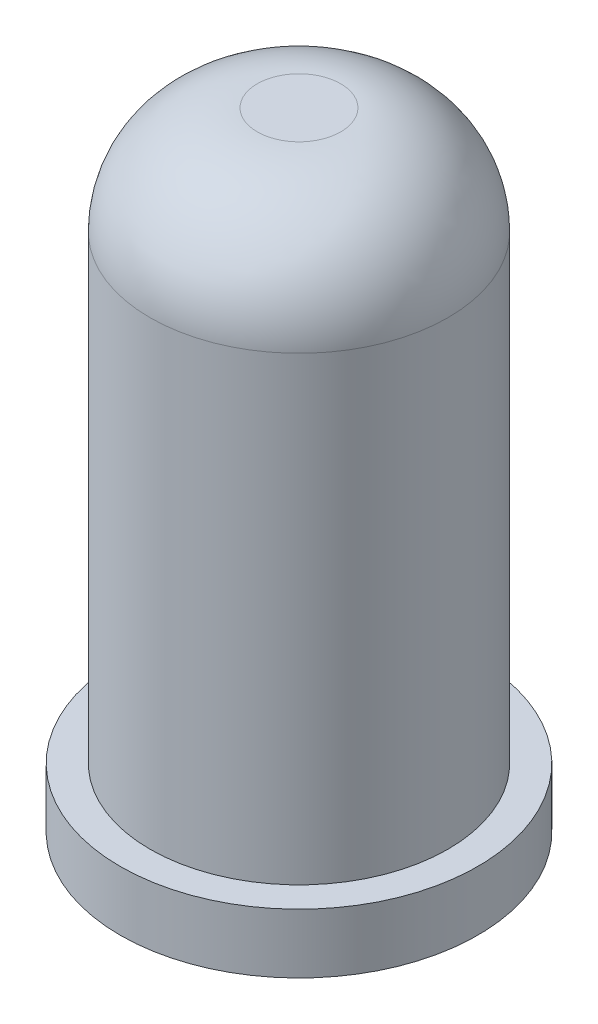
ISO-10303-21;
HEADER;
FILE_DESCRIPTION(('STEP AP214'),'2;1');
FILE_NAME('part.step','',(''),(''),'','','');
FILE_SCHEMA(('AUTOMOTIVE_DESIGN { 1 0 10303 214 1 1 1 1 }'));
ENDSEC;
DATA;
#1=APPLICATION_CONTEXT('core data for automotive mechanical design processes');
#2=APPLICATION_PROTOCOL_DEFINITION('international standard','automotive_design',2000,#1);
#3=PRODUCT_CONTEXT('',#1,'mechanical');
#4=PRODUCT('Part','Part','',(#3));
#5=PRODUCT_RELATED_PRODUCT_CATEGORY('part','',(#4));
#6=PRODUCT_DEFINITION_FORMATION('','',#4);
#7=PRODUCT_DEFINITION_CONTEXT('part definition',#1,'design');
#8=PRODUCT_DEFINITION('design','',#6,#7);
#9=PRODUCT_DEFINITION_SHAPE('','',#8);
#10=(LENGTH_UNIT() NAMED_UNIT(*) SI_UNIT(.MILLI.,.METRE.));
#11=(NAMED_UNIT(*) PLANE_ANGLE_UNIT() SI_UNIT($,.RADIAN.));
#12=(NAMED_UNIT(*) SI_UNIT($,.STERADIAN.) SOLID_ANGLE_UNIT());
#13=UNCERTAINTY_MEASURE_WITH_UNIT(LENGTH_MEASURE(1.E-05),#10,'distance_accuracy_value','');
#14=(GEOMETRIC_REPRESENTATION_CONTEXT(3) GLOBAL_UNCERTAINTY_ASSIGNED_CONTEXT((#13)) GLOBAL_UNIT_ASSIGNED_CONTEXT((#10,
#11,#12)) REPRESENTATION_CONTEXT('',''));
#15=CARTESIAN_POINT('',(0.,0.,0.));
#16=DIRECTION('',(0.,0.,1.));
#17=DIRECTION('',(1.,0.,0.));
#18=AXIS2_PLACEMENT_3D('',#15,#16,#17);
#19=CARTESIAN_POINT('',(0.,9.525,0.));
#20=DIRECTION('',(0.,-1.,0.));
#21=DIRECTION('',(0.,0.,-1.));
#22=AXIS2_PLACEMENT_3D('',#19,#20,#21);
#23=CYLINDRICAL_SURFACE('',#22,2.5);
#24=CARTESIAN_POINT('',(0.,7.725,0.));
#25=DIRECTION('',(0.,1.,0.));
#26=DIRECTION('',(0.,0.,1.));
#27=AXIS2_PLACEMENT_3D('',#24,#25,#26);
#28=CIRCLE('',#27,2.5);
#29=CARTESIAN_POINT('',(0.,7.725,2.5));
#30=VERTEX_POINT('',#29);
#31=EDGE_CURVE('E10',#30,#30,#28,.F.);
#32=ORIENTED_EDGE('',*,*,#31,.T.);
#33=EDGE_LOOP('',(#32));
#34=FACE_BOUND('',#33,.T.);
#35=CARTESIAN_POINT('',(0.,0.,0.));
#36=DIRECTION('',(0.,-1.,0.));
#37=DIRECTION('',(0.,0.,-1.));
#38=AXIS2_PLACEMENT_3D('',#35,#36,#37);
#39=CIRCLE('',#38,2.5);
#40=CARTESIAN_POINT('',(0.,0.,-2.5));
#41=VERTEX_POINT('',#40);
#42=EDGE_CURVE('E44',#41,#41,#39,.T.);
#43=ORIENTED_EDGE('',*,*,#42,.F.);
#44=EDGE_LOOP('',(#43));
#45=FACE_BOUND('',#44,.T.);
#46=ADVANCED_FACE('F33',(#34,#45),#23,.T.);
#47=CARTESIAN_POINT('',(0.,9.525,0.));
#48=DIRECTION('',(0.,1.,0.));
#49=DIRECTION('',(0.,0.,1.));
#50=AXIS2_PLACEMENT_3D('',#47,#48,#49);
#51=PLANE('',#50);
#52=CARTESIAN_POINT('',(0.,9.525,0.));
#53=DIRECTION('',(0.,1.,0.));
#54=DIRECTION('',(0.,0.,1.));
#55=AXIS2_PLACEMENT_3D('',#52,#53,#54);
#56=CIRCLE('',#55,0.700000000000002);
#57=CARTESIAN_POINT('',(0.,9.525,0.700000000000002));
#58=VERTEX_POINT('',#57);
#59=EDGE_CURVE('E40',#58,#58,#56,.T.);
#60=ORIENTED_EDGE('',*,*,#59,.T.);
#61=EDGE_LOOP('',(#60));
#62=FACE_BOUND('',#61,.T.);
#63=ADVANCED_FACE('F62',(#62),#51,.T.);
#64=CARTESIAN_POINT('',(0.,-1.,0.));
#65=DIRECTION('',(0.,1.,0.));
#66=DIRECTION('',(0.,0.,1.));
#67=AXIS2_PLACEMENT_3D('',#64,#65,#66);
#68=CYLINDRICAL_SURFACE('',#67,3.);
#69=CARTESIAN_POINT('',(0.,-1.,0.));
#70=DIRECTION('',(0.,-1.,0.));
#71=DIRECTION('',(0.,0.,-1.));
#72=AXIS2_PLACEMENT_3D('',#69,#70,#71);
#73=CIRCLE('',#72,3.);
#74=CARTESIAN_POINT('',(0.,-1.,-3.));
#75=VERTEX_POINT('',#74);
#76=EDGE_CURVE('E48',#75,#75,#73,.T.);
#77=ORIENTED_EDGE('',*,*,#76,.F.);
#78=EDGE_LOOP('',(#77));
#79=FACE_BOUND('',#78,.T.);
#80=CARTESIAN_POINT('',(0.,0.,0.));
#81=DIRECTION('',(0.,-1.,0.));
#82=DIRECTION('',(0.,0.,-1.));
#83=AXIS2_PLACEMENT_3D('',#80,#81,#82);
#84=CIRCLE('',#83,3.);
#85=CARTESIAN_POINT('',(0.,0.,-3.));
#86=VERTEX_POINT('',#85);
#87=EDGE_CURVE('E51',#86,#86,#84,.T.);
#88=ORIENTED_EDGE('',*,*,#87,.T.);
#89=EDGE_LOOP('',(#88));
#90=FACE_BOUND('',#89,.T.);
#91=ADVANCED_FACE('F59',(#79,#90),#68,.T.);
#92=CARTESIAN_POINT('',(0.,-1.,0.));
#93=DIRECTION('',(0.,-1.,0.));
#94=DIRECTION('',(0.,0.,-1.));
#95=AXIS2_PLACEMENT_3D('',#92,#93,#94);
#96=PLANE('',#95);
#97=ORIENTED_EDGE('',*,*,#76,.T.);
#98=EDGE_LOOP('',(#97));
#99=FACE_BOUND('',#98,.T.);
#100=ADVANCED_FACE('F57',(#99),#96,.T.);
#101=CARTESIAN_POINT('',(0.,0.,0.));
#102=DIRECTION('',(0.,-1.,0.));
#103=DIRECTION('',(0.,0.,-1.));
#104=AXIS2_PLACEMENT_3D('',#101,#102,#103);
#105=PLANE('',#104);
#106=ORIENTED_EDGE('',*,*,#42,.T.);
#107=EDGE_LOOP('',(#106));
#108=FACE_BOUND('',#107,.T.);
#109=ORIENTED_EDGE('',*,*,#87,.F.);
#110=EDGE_LOOP('',(#109));
#111=FACE_BOUND('',#110,.T.);
#112=ADVANCED_FACE('F66',(#108,#111),#105,.F.);
#113=CARTESIAN_POINT('',(0.,7.725,0.));
#114=DIRECTION('',(0.,1.,0.));
#115=DIRECTION('',(0.,0.,1.));
#116=AXIS2_PLACEMENT_3D('',#113,#114,#115);
#117=DEGENERATE_TOROIDAL_SURFACE('',#116,0.700000000000002,1.8,.T.);
#118=ORIENTED_EDGE('',*,*,#31,.F.);
#119=EDGE_LOOP('',(#118));
#120=FACE_BOUND('',#119,.T.);
#121=ORIENTED_EDGE('',*,*,#59,.F.);
#122=EDGE_LOOP('',(#121));
#123=FACE_BOUND('',#122,.T.);
#124=ADVANCED_FACE('F35',(#120,#123),#117,.T.);
#125=CLOSED_SHELL('',(#46,#63,#91,#100,#112,#124));
#126=MANIFOLD_SOLID_BREP('B2',#125);
#127=ADVANCED_BREP_SHAPE_REPRESENTATION('',(#18,#126),#14);
#128=SHAPE_DEFINITION_REPRESENTATION(#9,#127);
ENDSEC;
END-ISO-10303-21;
